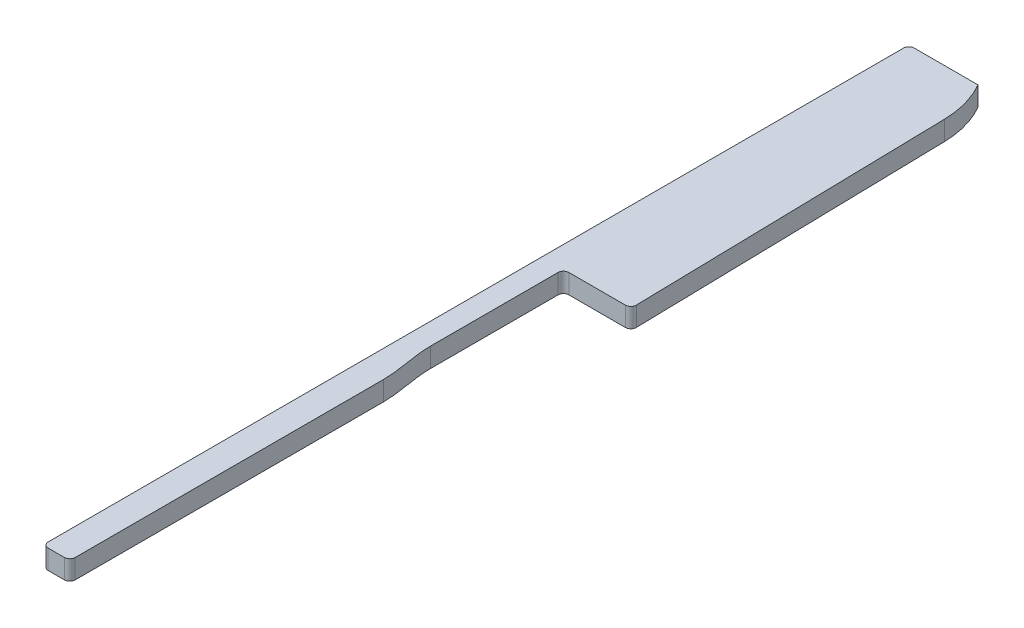
ISO-10303-21;
HEADER;
FILE_DESCRIPTION(('STEP AP214'),'2;1');
FILE_NAME('part.step','',(''),(''),'','','');
FILE_SCHEMA(('AUTOMOTIVE_DESIGN { 1 0 10303 214 1 1 1 1 }'));
ENDSEC;
DATA;
#1=APPLICATION_CONTEXT('core data for automotive mechanical design processes');
#2=APPLICATION_PROTOCOL_DEFINITION('international standard','automotive_design',2000,#1);
#3=PRODUCT_CONTEXT('',#1,'mechanical');
#4=PRODUCT('Part','Part','',(#3));
#5=PRODUCT_RELATED_PRODUCT_CATEGORY('part','',(#4));
#6=PRODUCT_DEFINITION_FORMATION('','',#4);
#7=PRODUCT_DEFINITION_CONTEXT('part definition',#1,'design');
#8=PRODUCT_DEFINITION('design','',#6,#7);
#9=PRODUCT_DEFINITION_SHAPE('','',#8);
#10=(LENGTH_UNIT() NAMED_UNIT(*) SI_UNIT(.MILLI.,.METRE.));
#11=(NAMED_UNIT(*) PLANE_ANGLE_UNIT() SI_UNIT($,.RADIAN.));
#12=(NAMED_UNIT(*) SI_UNIT($,.STERADIAN.) SOLID_ANGLE_UNIT());
#13=UNCERTAINTY_MEASURE_WITH_UNIT(LENGTH_MEASURE(1.E-05),#10,'distance_accuracy_value','');
#14=(GEOMETRIC_REPRESENTATION_CONTEXT(3) GLOBAL_UNCERTAINTY_ASSIGNED_CONTEXT((#13)) GLOBAL_UNIT_ASSIGNED_CONTEXT((#10,
#11,#12)) REPRESENTATION_CONTEXT('',''));
#15=CARTESIAN_POINT('',(0.,0.,0.));
#16=DIRECTION('',(0.,0.,1.));
#17=DIRECTION('',(1.,0.,0.));
#18=AXIS2_PLACEMENT_3D('',#15,#16,#17);
#19=CARTESIAN_POINT('',(12.5,1.8,-32.33));
#20=DIRECTION('',(-1.,0.,0.));
#21=DIRECTION('',(0.,0.,1.));
#22=AXIS2_PLACEMENT_3D('',#19,#20,#21);
#23=PLANE('',#22);
#24=DIRECTION('',(0.,0.,-1.));
#25=VECTOR('',#24,1.);
#26=CARTESIAN_POINT('',(12.5,1.8,-32.33));
#27=LINE('',#26,#25);
#28=CARTESIAN_POINT('',(12.5,1.8,-3.77));
#29=VERTEX_POINT('',#28);
#30=CARTESIAN_POINT('',(12.5,1.8,-32.33));
#31=VERTEX_POINT('',#30);
#32=EDGE_CURVE('E137',#29,#31,#27,.T.);
#33=ORIENTED_EDGE('',*,*,#32,.F.);
#34=DIRECTION('',(0.,-1.,0.));
#35=VECTOR('',#34,1.);
#36=CARTESIAN_POINT('',(12.5,1.8,-3.77));
#37=LINE('',#36,#35);
#38=CARTESIAN_POINT('',(12.5,0.,-3.77));
#39=VERTEX_POINT('',#38);
#40=EDGE_CURVE('E11',#29,#39,#37,.T.);
#41=ORIENTED_EDGE('',*,*,#40,.T.);
#42=DIRECTION('',(0.,0.,-1.));
#43=VECTOR('',#42,1.);
#44=CARTESIAN_POINT('',(12.5,0.,-32.33));
#45=LINE('',#44,#43);
#46=CARTESIAN_POINT('',(12.5,0.,-32.33));
#47=VERTEX_POINT('',#46);
#48=EDGE_CURVE('E154',#39,#47,#45,.T.);
#49=ORIENTED_EDGE('',*,*,#48,.T.);
#50=DIRECTION('',(0.,-1.,0.));
#51=VECTOR('',#50,1.);
#52=CARTESIAN_POINT('',(12.5,1.8,-32.33));
#53=LINE('',#52,#51);
#54=EDGE_CURVE('E152',#31,#47,#53,.T.);
#55=ORIENTED_EDGE('',*,*,#54,.F.);
#56=EDGE_LOOP('',(#33,#41,#49,#55));
#57=FACE_BOUND('',#56,.T.);
#58=ADVANCED_FACE('F35',(#57),#23,.F.);
#59=CARTESIAN_POINT('',(12.5,1.8,-32.33));
#60=CARTESIAN_POINT('',(12.5,1.8,-33.9722823380889));
#61=CARTESIAN_POINT('',(12.,1.8,-35.554764974261));
#62=CARTESIAN_POINT('',(12.,1.8,-37.18));
#63=B_SPLINE_CURVE_WITH_KNOTS('',3,(#59,#60,#61,#62),.UNSPECIFIED.,.F.,.F.,(4,4),(0.,1.),.UNSPECIFIED.);
#64=DIRECTION('',(0.,-1.,0.));
#65=VECTOR('',#64,1.);
#66=SURFACE_OF_LINEAR_EXTRUSION('',#63,#65);
#67=CARTESIAN_POINT('',(12.5,0.,-32.33));
#68=CARTESIAN_POINT('',(12.5,0.,-33.9722823380889));
#69=CARTESIAN_POINT('',(12.,0.,-35.554764974261));
#70=CARTESIAN_POINT('',(12.,0.,-37.18));
#71=B_SPLINE_CURVE_WITH_KNOTS('',3,(#67,#68,#69,#70),.UNSPECIFIED.,.F.,.F.,(4,4),(0.,1.),.UNSPECIFIED.);
#72=CARTESIAN_POINT('',(12.,0.,-37.18));
#73=VERTEX_POINT('',#72);
#74=EDGE_CURVE('E268',#47,#73,#71,.T.);
#75=ORIENTED_EDGE('',*,*,#74,.T.);
#76=DIRECTION('',(0.,-1.,0.));
#77=VECTOR('',#76,1.);
#78=CARTESIAN_POINT('',(12.,1.8,-37.18));
#79=LINE('',#78,#77);
#80=CARTESIAN_POINT('',(12.,1.8,-37.18));
#81=VERTEX_POINT('',#80);
#82=EDGE_CURVE('E158',#81,#73,#79,.T.);
#83=ORIENTED_EDGE('',*,*,#82,.F.);
#84=EDGE_CURVE('E143',#31,#81,#63,.T.);
#85=ORIENTED_EDGE('',*,*,#84,.F.);
#86=ORIENTED_EDGE('',*,*,#54,.T.);
#87=EDGE_LOOP('',(#75,#83,#85,#86));
#88=FACE_BOUND('',#87,.T.);
#89=ADVANCED_FACE('F160',(#88),#66,.F.);
#90=CARTESIAN_POINT('',(12.,1.8,-37.18));
#91=DIRECTION('',(-1.,0.,0.));
#92=DIRECTION('',(0.,0.,1.));
#93=AXIS2_PLACEMENT_3D('',#90,#91,#92);
#94=PLANE('',#93);
#95=DIRECTION('',(0.,0.,-1.));
#96=VECTOR('',#95,1.);
#97=CARTESIAN_POINT('',(12.,0.,-37.18));
#98=LINE('',#97,#96);
#99=CARTESIAN_POINT('',(12.,0.,-49.));
#100=VERTEX_POINT('',#99);
#101=EDGE_CURVE('E265',#73,#100,#98,.T.);
#102=ORIENTED_EDGE('',*,*,#101,.T.);
#103=DIRECTION('',(0.,-1.,0.));
#104=VECTOR('',#103,1.);
#105=CARTESIAN_POINT('',(12.,1.8,-49.));
#106=LINE('',#105,#104);
#107=CARTESIAN_POINT('',(12.,1.8,-49.));
#108=VERTEX_POINT('',#107);
#109=EDGE_CURVE('E240',#100,#108,#106,.F.);
#110=ORIENTED_EDGE('',*,*,#109,.T.);
#111=DIRECTION('',(0.,0.,-1.));
#112=VECTOR('',#111,1.);
#113=CARTESIAN_POINT('',(12.,1.8,-37.18));
#114=LINE('',#113,#112);
#115=EDGE_CURVE('E163',#81,#108,#114,.T.);
#116=ORIENTED_EDGE('',*,*,#115,.F.);
#117=ORIENTED_EDGE('',*,*,#82,.T.);
#118=EDGE_LOOP('',(#102,#110,#116,#117));
#119=FACE_BOUND('',#118,.T.);
#120=ADVANCED_FACE('F179',(#119),#94,.F.);
#121=CARTESIAN_POINT('',(18.25,1.8,-49.5));
#122=DIRECTION('',(0.,0.,-1.));
#123=DIRECTION('',(-1.,0.,0.));
#124=AXIS2_PLACEMENT_3D('',#121,#122,#123);
#125=PLANE('',#124);
#126=DIRECTION('',(1.,0.,0.));
#127=VECTOR('',#126,1.);
#128=CARTESIAN_POINT('',(18.25,1.8,-49.5));
#129=LINE('',#128,#127);
#130=CARTESIAN_POINT('',(12.5,1.8,-49.5));
#131=VERTEX_POINT('',#130);
#132=CARTESIAN_POINT('',(17.7389709464066,1.8,-49.5));
#133=VERTEX_POINT('',#132);
#134=EDGE_CURVE('E165',#131,#133,#129,.T.);
#135=ORIENTED_EDGE('',*,*,#134,.F.);
#136=DIRECTION('',(0.,-1.,0.));
#137=VECTOR('',#136,1.);
#138=CARTESIAN_POINT('',(12.5,0.,-49.5));
#139=LINE('',#138,#137);
#140=CARTESIAN_POINT('',(12.5,0.,-49.5));
#141=VERTEX_POINT('',#140);
#142=EDGE_CURVE('E242',#131,#141,#139,.T.);
#143=ORIENTED_EDGE('',*,*,#142,.T.);
#144=DIRECTION('',(1.,0.,0.));
#145=VECTOR('',#144,1.);
#146=CARTESIAN_POINT('',(18.25,0.,-49.5));
#147=LINE('',#146,#145);
#148=CARTESIAN_POINT('',(17.7389709464066,0.,-49.5));
#149=VERTEX_POINT('',#148);
#150=EDGE_CURVE('E262',#141,#149,#147,.T.);
#151=ORIENTED_EDGE('',*,*,#150,.T.);
#152=DIRECTION('',(0.,-1.,0.));
#153=VECTOR('',#152,1.);
#154=CARTESIAN_POINT('',(17.7389709464066,1.8,-49.5));
#155=LINE('',#154,#153);
#156=EDGE_CURVE('E157',#149,#133,#155,.F.);
#157=ORIENTED_EDGE('',*,*,#156,.T.);
#158=EDGE_LOOP('',(#135,#143,#151,#157));
#159=FACE_BOUND('',#158,.T.);
#160=ADVANCED_FACE('F318',(#159),#125,.F.);
#161=CARTESIAN_POINT('',(17.6019605823982,1.8,-79.1992260441899));
#162=DIRECTION('',(-0.999762027079909,0.,0.0218148850345542));
#163=DIRECTION('',(0.0218148850345542,0.,0.999762027079909));
#164=AXIS2_PLACEMENT_3D('',#161,#162,#163);
#165=PLANE('',#164);
#166=DIRECTION('',(-0.0218148850345542,0.,-0.999762027079909));
#167=VECTOR('',#166,1.);
#168=CARTESIAN_POINT('',(17.6019605823982,1.8,-79.1992260441899));
#169=LINE('',#168,#167);
#170=CARTESIAN_POINT('',(18.2388519599465,1.8,-50.0109074425173));
#171=VERTEX_POINT('',#170);
#172=CARTESIAN_POINT('',(17.6019605823982,1.8,-79.1992260441899));
#173=VERTEX_POINT('',#172);
#174=EDGE_CURVE('E283',#171,#173,#169,.T.);
#175=ORIENTED_EDGE('',*,*,#174,.F.);
#176=DIRECTION('',(0.,-1.,0.));
#177=VECTOR('',#176,1.);
#178=CARTESIAN_POINT('',(18.2388519599465,1.8,-50.0109074425173));
#179=LINE('',#178,#177);
#180=CARTESIAN_POINT('',(18.2388519599465,0.,-50.0109074425173));
#181=VERTEX_POINT('',#180);
#182=EDGE_CURVE('E237',#171,#181,#179,.T.);
#183=ORIENTED_EDGE('',*,*,#182,.T.);
#184=DIRECTION('',(-0.0218148850345542,0.,-0.999762027079909));
#185=VECTOR('',#184,1.);
#186=CARTESIAN_POINT('',(17.6019605823982,0.,-79.1992260441899));
#187=LINE('',#186,#185);
#188=CARTESIAN_POINT('',(17.6019605823982,0.,-79.1992260441899));
#189=VERTEX_POINT('',#188);
#190=EDGE_CURVE('E260',#181,#189,#187,.T.);
#191=ORIENTED_EDGE('',*,*,#190,.T.);
#192=DIRECTION('',(0.,-1.,0.));
#193=VECTOR('',#192,1.);
#194=CARTESIAN_POINT('',(17.6019605823982,1.8,-79.1992260441899));
#195=LINE('',#194,#193);
#196=EDGE_CURVE('E247',#173,#189,#195,.T.);
#197=ORIENTED_EDGE('',*,*,#196,.F.);
#198=EDGE_LOOP('',(#175,#183,#191,#197));
#199=FACE_BOUND('',#198,.T.);
#200=ADVANCED_FACE('F295',(#199),#165,.F.);
#201=CARTESIAN_POINT('',(8.60410233867904,1.8,-79.0028920788789));
#202=DIRECTION('',(0.,-1.,0.));
#203=DIRECTION('',(0.,0.,-1.));
#204=AXIS2_PLACEMENT_3D('',#201,#202,#203);
#205=CYLINDRICAL_SURFACE('',#204,9.);
#206=CARTESIAN_POINT('',(8.60410233867904,0.,-79.0028920788789));
#207=DIRECTION('',(0.,1.,0.));
#208=DIRECTION('',(0.,0.,1.));
#209=AXIS2_PLACEMENT_3D('',#206,#207,#208);
#210=CIRCLE('',#209,9.);
#211=CARTESIAN_POINT('',(16.4,0.,-83.5));
#212=VERTEX_POINT('',#211);
#213=EDGE_CURVE('E258',#189,#212,#210,.T.);
#214=ORIENTED_EDGE('',*,*,#213,.T.);
#215=DIRECTION('',(0.,-1.,0.));
#216=VECTOR('',#215,1.);
#217=CARTESIAN_POINT('',(16.4,1.8,-83.5));
#218=LINE('',#217,#216);
#219=CARTESIAN_POINT('',(16.4,1.8,-83.5));
#220=VERTEX_POINT('',#219);
#221=EDGE_CURVE('E250',#220,#212,#218,.T.);
#222=ORIENTED_EDGE('',*,*,#221,.F.);
#223=CARTESIAN_POINT('',(8.60410233867904,1.8,-79.0028920788789));
#224=DIRECTION('',(0.,1.,0.));
#225=DIRECTION('',(0.,0.,1.));
#226=AXIS2_PLACEMENT_3D('',#223,#224,#225);
#227=CIRCLE('',#226,9.);
#228=EDGE_CURVE('E281',#173,#220,#227,.T.);
#229=ORIENTED_EDGE('',*,*,#228,.F.);
#230=ORIENTED_EDGE('',*,*,#196,.T.);
#231=EDGE_LOOP('',(#214,#222,#229,#230));
#232=FACE_BOUND('',#231,.T.);
#233=ADVANCED_FACE('F302',(#232),#205,.T.);
#234=CARTESIAN_POINT('',(10.,1.8,-83.5));
#235=DIRECTION('',(0.,0.,1.));
#236=DIRECTION('',(1.,0.,0.));
#237=AXIS2_PLACEMENT_3D('',#234,#235,#236);
#238=PLANE('',#237);
#239=DIRECTION('',(-1.,0.,0.));
#240=VECTOR('',#239,1.);
#241=CARTESIAN_POINT('',(10.,0.,-83.5));
#242=LINE('',#241,#240);
#243=CARTESIAN_POINT('',(10.5,0.,-83.5));
#244=VERTEX_POINT('',#243);
#245=EDGE_CURVE('E255',#212,#244,#242,.T.);
#246=ORIENTED_EDGE('',*,*,#245,.T.);
#247=DIRECTION('',(0.,-1.,0.));
#248=VECTOR('',#247,1.);
#249=CARTESIAN_POINT('',(10.5,1.8,-83.5));
#250=LINE('',#249,#248);
#251=CARTESIAN_POINT('',(10.5,1.8,-83.5));
#252=VERTEX_POINT('',#251);
#253=EDGE_CURVE('E224',#244,#252,#250,.F.);
#254=ORIENTED_EDGE('',*,*,#253,.T.);
#255=DIRECTION('',(-1.,0.,0.));
#256=VECTOR('',#255,1.);
#257=CARTESIAN_POINT('',(10.,1.8,-83.5));
#258=LINE('',#257,#256);
#259=EDGE_CURVE('E278',#220,#252,#258,.T.);
#260=ORIENTED_EDGE('',*,*,#259,.F.);
#261=ORIENTED_EDGE('',*,*,#221,.T.);
#262=EDGE_LOOP('',(#246,#254,#260,#261));
#263=FACE_BOUND('',#262,.T.);
#264=ADVANCED_FACE('F306',(#263),#238,.F.);
#265=CARTESIAN_POINT('',(10.,1.8,-14.4));
#266=DIRECTION('',(1.,0.,0.));
#267=DIRECTION('',(0.,0.,-1.));
#268=AXIS2_PLACEMENT_3D('',#265,#266,#267);
#269=PLANE('',#268);
#270=DIRECTION('',(0.,0.,1.));
#271=VECTOR('',#270,1.);
#272=CARTESIAN_POINT('',(10.,0.,-14.4));
#273=LINE('',#272,#271);
#274=CARTESIAN_POINT('',(10.,0.,-83.));
#275=VERTEX_POINT('',#274);
#276=CARTESIAN_POINT('',(10.,0.,-3.77));
#277=VERTEX_POINT('',#276);
#278=EDGE_CURVE('E149',#275,#277,#273,.T.);
#279=ORIENTED_EDGE('',*,*,#278,.T.);
#280=DIRECTION('',(0.,1.,0.));
#281=VECTOR('',#280,1.);
#282=CARTESIAN_POINT('',(10.,1.8,-3.77));
#283=LINE('',#282,#281);
#284=CARTESIAN_POINT('',(10.,1.8,-3.77));
#285=VERTEX_POINT('',#284);
#286=EDGE_CURVE('E207',#277,#285,#283,.T.);
#287=ORIENTED_EDGE('',*,*,#286,.T.);
#288=DIRECTION('',(0.,0.,1.));
#289=VECTOR('',#288,1.);
#290=CARTESIAN_POINT('',(10.,1.8,-14.4));
#291=LINE('',#290,#289);
#292=CARTESIAN_POINT('',(10.,1.8,-83.));
#293=VERTEX_POINT('',#292);
#294=EDGE_CURVE('E253',#293,#285,#291,.T.);
#295=ORIENTED_EDGE('',*,*,#294,.F.);
#296=DIRECTION('',(0.,-1.,0.));
#297=VECTOR('',#296,1.);
#298=CARTESIAN_POINT('',(10.,1.8,-83.));
#299=LINE('',#298,#297);
#300=EDGE_CURVE('E226',#293,#275,#299,.T.);
#301=ORIENTED_EDGE('',*,*,#300,.T.);
#302=EDGE_LOOP('',(#279,#287,#295,#301));
#303=FACE_BOUND('',#302,.T.);
#304=ADVANCED_FACE('F312',(#303),#269,.F.);
#305=CARTESIAN_POINT('',(9.43,1.8,-12.1305444444443));
#306=DIRECTION('',(0.,-1.,0.));
#307=DIRECTION('',(0.,0.,-1.));
#308=AXIS2_PLACEMENT_3D('',#305,#306,#307);
#309=PLANE('',#308);
#310=ORIENTED_EDGE('',*,*,#294,.T.);
#311=CARTESIAN_POINT('',(10.5,1.8,-3.77));
#312=DIRECTION('',(0.,-1.,0.));
#313=DIRECTION('',(0.,0.,-1.));
#314=AXIS2_PLACEMENT_3D('',#311,#312,#313);
#315=CIRCLE('',#314,0.5);
#316=CARTESIAN_POINT('',(10.5,1.8,-3.27));
#317=VERTEX_POINT('',#316);
#318=EDGE_CURVE('E216',#285,#317,#315,.F.);
#319=ORIENTED_EDGE('',*,*,#318,.T.);
#320=DIRECTION('',(-1.,0.,0.));
#321=VECTOR('',#320,1.);
#322=CARTESIAN_POINT('',(10.,1.8,-3.27));
#323=LINE('',#322,#321);
#324=CARTESIAN_POINT('',(12.,1.8,-3.27));
#325=VERTEX_POINT('',#324);
#326=EDGE_CURVE('E313',#325,#317,#323,.T.);
#327=ORIENTED_EDGE('',*,*,#326,.F.);
#328=CARTESIAN_POINT('',(12.,1.8,-3.77));
#329=DIRECTION('',(0.,-1.,0.));
#330=DIRECTION('',(0.,0.,-1.));
#331=AXIS2_PLACEMENT_3D('',#328,#329,#330);
#332=CIRCLE('',#331,0.5);
#333=EDGE_CURVE('E147',#325,#29,#332,.F.);
#334=ORIENTED_EDGE('',*,*,#333,.T.);
#335=ORIENTED_EDGE('',*,*,#32,.T.);
#336=ORIENTED_EDGE('',*,*,#84,.T.);
#337=ORIENTED_EDGE('',*,*,#115,.T.);
#338=CARTESIAN_POINT('',(12.5,1.8,-49.));
#339=DIRECTION('',(0.,-1.,0.));
#340=DIRECTION('',(0.,0.,-1.));
#341=AXIS2_PLACEMENT_3D('',#338,#339,#340);
#342=CIRCLE('',#341,0.5);
#343=EDGE_CURVE('E220',#108,#131,#342,.T.);
#344=ORIENTED_EDGE('',*,*,#343,.T.);
#345=ORIENTED_EDGE('',*,*,#134,.T.);
#346=CARTESIAN_POINT('',(17.7389709464066,1.8,-50.));
#347=DIRECTION('',(0.,-1.,0.));
#348=DIRECTION('',(0.,0.,-1.));
#349=AXIS2_PLACEMENT_3D('',#346,#347,#348);
#350=CIRCLE('',#349,0.5);
#351=EDGE_CURVE('E229',#133,#171,#350,.F.);
#352=ORIENTED_EDGE('',*,*,#351,.T.);
#353=ORIENTED_EDGE('',*,*,#174,.T.);
#354=ORIENTED_EDGE('',*,*,#228,.T.);
#355=ORIENTED_EDGE('',*,*,#259,.T.);
#356=CARTESIAN_POINT('',(10.5,1.8,-83.));
#357=DIRECTION('',(0.,-1.,0.));
#358=DIRECTION('',(0.,0.,-1.));
#359=AXIS2_PLACEMENT_3D('',#356,#357,#358);
#360=CIRCLE('',#359,0.5);
#361=EDGE_CURVE('E231',#252,#293,#360,.F.);
#362=ORIENTED_EDGE('',*,*,#361,.T.);
#363=EDGE_LOOP('',(#310,#319,#327,#334,#335,#336,#337,#344,#345,#352,#353,#354,#355,#362));
#364=FACE_BOUND('',#363,.T.);
#365=ADVANCED_FACE('F140',(#364),#309,.F.);
#366=CARTESIAN_POINT('',(9.43,0.,-12.1305444444443));
#367=DIRECTION('',(0.,-1.,0.));
#368=DIRECTION('',(0.,0.,-1.));
#369=AXIS2_PLACEMENT_3D('',#366,#367,#368);
#370=PLANE('',#369);
#371=DIRECTION('',(-1.,0.,0.));
#372=VECTOR('',#371,1.);
#373=CARTESIAN_POINT('',(10.,0.,-3.27));
#374=LINE('',#373,#372);
#375=CARTESIAN_POINT('',(12.,0.,-3.27));
#376=VERTEX_POINT('',#375);
#377=CARTESIAN_POINT('',(10.5,0.,-3.27));
#378=VERTEX_POINT('',#377);
#379=EDGE_CURVE('E276',#376,#378,#374,.T.);
#380=ORIENTED_EDGE('',*,*,#379,.T.);
#381=CARTESIAN_POINT('',(10.5,0.,-3.77));
#382=DIRECTION('',(0.,-1.,0.));
#383=DIRECTION('',(0.,0.,-1.));
#384=AXIS2_PLACEMENT_3D('',#381,#382,#383);
#385=CIRCLE('',#384,0.5);
#386=EDGE_CURVE('E43',#378,#277,#385,.T.);
#387=ORIENTED_EDGE('',*,*,#386,.T.);
#388=ORIENTED_EDGE('',*,*,#278,.F.);
#389=CARTESIAN_POINT('',(10.5,0.,-83.));
#390=DIRECTION('',(0.,-1.,0.));
#391=DIRECTION('',(0.,0.,-1.));
#392=AXIS2_PLACEMENT_3D('',#389,#390,#391);
#393=CIRCLE('',#392,0.5);
#394=EDGE_CURVE('E235',#275,#244,#393,.T.);
#395=ORIENTED_EDGE('',*,*,#394,.T.);
#396=ORIENTED_EDGE('',*,*,#245,.F.);
#397=ORIENTED_EDGE('',*,*,#213,.F.);
#398=ORIENTED_EDGE('',*,*,#190,.F.);
#399=CARTESIAN_POINT('',(17.7389709464066,0.,-50.));
#400=DIRECTION('',(0.,-1.,0.));
#401=DIRECTION('',(0.,0.,-1.));
#402=AXIS2_PLACEMENT_3D('',#399,#400,#401);
#403=CIRCLE('',#402,0.5);
#404=EDGE_CURVE('E233',#181,#149,#403,.T.);
#405=ORIENTED_EDGE('',*,*,#404,.T.);
#406=ORIENTED_EDGE('',*,*,#150,.F.);
#407=CARTESIAN_POINT('',(12.5,0.,-49.));
#408=DIRECTION('',(0.,-1.,0.));
#409=DIRECTION('',(0.,0.,-1.));
#410=AXIS2_PLACEMENT_3D('',#407,#408,#409);
#411=CIRCLE('',#410,0.5);
#412=EDGE_CURVE('E222',#141,#100,#411,.F.);
#413=ORIENTED_EDGE('',*,*,#412,.T.);
#414=ORIENTED_EDGE('',*,*,#101,.F.);
#415=ORIENTED_EDGE('',*,*,#74,.F.);
#416=ORIENTED_EDGE('',*,*,#48,.F.);
#417=CARTESIAN_POINT('',(12.,0.,-3.77));
#418=DIRECTION('',(0.,-1.,0.));
#419=DIRECTION('',(0.,0.,-1.));
#420=AXIS2_PLACEMENT_3D('',#417,#418,#419);
#421=CIRCLE('',#420,0.5);
#422=EDGE_CURVE('E50',#39,#376,#421,.T.);
#423=ORIENTED_EDGE('',*,*,#422,.T.);
#424=EDGE_LOOP('',(#380,#387,#388,#395,#396,#397,#398,#405,#406,#413,#414,#415,#416,#423));
#425=FACE_BOUND('',#424,.T.);
#426=ADVANCED_FACE('F187',(#425),#370,.T.);
#427=CARTESIAN_POINT('',(12.5,1.8,-49.));
#428=DIRECTION('',(0.,1.,0.));
#429=DIRECTION('',(0.,0.,1.));
#430=AXIS2_PLACEMENT_3D('',#427,#428,#429);
#431=CYLINDRICAL_SURFACE('',#430,0.5);
#432=ORIENTED_EDGE('',*,*,#343,.F.);
#433=ORIENTED_EDGE('',*,*,#109,.F.);
#434=ORIENTED_EDGE('',*,*,#412,.F.);
#435=ORIENTED_EDGE('',*,*,#142,.F.);
#436=EDGE_LOOP('',(#432,#433,#434,#435));
#437=FACE_BOUND('',#436,.T.);
#438=ADVANCED_FACE('F183',(#437),#431,.F.);
#439=CARTESIAN_POINT('',(17.7389709464066,1.8,-50.));
#440=DIRECTION('',(0.,-1.,0.));
#441=DIRECTION('',(0.,0.,-1.));
#442=AXIS2_PLACEMENT_3D('',#439,#440,#441);
#443=CYLINDRICAL_SURFACE('',#442,0.5);
#444=ORIENTED_EDGE('',*,*,#351,.F.);
#445=ORIENTED_EDGE('',*,*,#156,.F.);
#446=ORIENTED_EDGE('',*,*,#404,.F.);
#447=ORIENTED_EDGE('',*,*,#182,.F.);
#448=EDGE_LOOP('',(#444,#445,#446,#447));
#449=FACE_BOUND('',#448,.T.);
#450=ADVANCED_FACE('F186',(#449),#443,.T.);
#451=CARTESIAN_POINT('',(10.5,1.8,-83.));
#452=DIRECTION('',(0.,-1.,0.));
#453=DIRECTION('',(0.,0.,-1.));
#454=AXIS2_PLACEMENT_3D('',#451,#452,#453);
#455=CYLINDRICAL_SURFACE('',#454,0.5);
#456=ORIENTED_EDGE('',*,*,#361,.F.);
#457=ORIENTED_EDGE('',*,*,#253,.F.);
#458=ORIENTED_EDGE('',*,*,#394,.F.);
#459=ORIENTED_EDGE('',*,*,#300,.F.);
#460=EDGE_LOOP('',(#456,#457,#458,#459));
#461=FACE_BOUND('',#460,.T.);
#462=ADVANCED_FACE('F191',(#461),#455,.T.);
#463=CARTESIAN_POINT('',(10.,0.,-3.27));
#464=DIRECTION('',(0.,0.,-1.));
#465=DIRECTION('',(-1.,0.,0.));
#466=AXIS2_PLACEMENT_3D('',#463,#464,#465);
#467=PLANE('',#466);
#468=ORIENTED_EDGE('',*,*,#326,.T.);
#469=DIRECTION('',(0.,1.,0.));
#470=VECTOR('',#469,1.);
#471=CARTESIAN_POINT('',(10.5,0.,-3.27));
#472=LINE('',#471,#470);
#473=EDGE_CURVE('E57',#317,#378,#472,.F.);
#474=ORIENTED_EDGE('',*,*,#473,.T.);
#475=ORIENTED_EDGE('',*,*,#379,.F.);
#476=DIRECTION('',(0.,-1.,0.));
#477=VECTOR('',#476,1.);
#478=CARTESIAN_POINT('',(12.,0.,-3.27));
#479=LINE('',#478,#477);
#480=EDGE_CURVE('E214',#376,#325,#479,.F.);
#481=ORIENTED_EDGE('',*,*,#480,.T.);
#482=EDGE_LOOP('',(#468,#474,#475,#481));
#483=FACE_BOUND('',#482,.T.);
#484=ADVANCED_FACE('F194',(#483),#467,.F.);
#485=CARTESIAN_POINT('',(10.5,1.8,-3.77));
#486=DIRECTION('',(0.,1.,0.));
#487=DIRECTION('',(0.,0.,1.));
#488=AXIS2_PLACEMENT_3D('',#485,#486,#487);
#489=CYLINDRICAL_SURFACE('',#488,0.5);
#490=ORIENTED_EDGE('',*,*,#386,.F.);
#491=ORIENTED_EDGE('',*,*,#473,.F.);
#492=ORIENTED_EDGE('',*,*,#318,.F.);
#493=ORIENTED_EDGE('',*,*,#286,.F.);
#494=EDGE_LOOP('',(#490,#491,#492,#493));
#495=FACE_BOUND('',#494,.T.);
#496=ADVANCED_FACE('F196',(#495),#489,.T.);
#497=CARTESIAN_POINT('',(12.,1.8,-3.77));
#498=DIRECTION('',(0.,-1.,0.));
#499=DIRECTION('',(0.,0.,-1.));
#500=AXIS2_PLACEMENT_3D('',#497,#498,#499);
#501=CYLINDRICAL_SURFACE('',#500,0.5);
#502=ORIENTED_EDGE('',*,*,#333,.F.);
#503=ORIENTED_EDGE('',*,*,#480,.F.);
#504=ORIENTED_EDGE('',*,*,#422,.F.);
#505=ORIENTED_EDGE('',*,*,#40,.F.);
#506=EDGE_LOOP('',(#502,#503,#504,#505));
#507=FACE_BOUND('',#506,.T.);
#508=ADVANCED_FACE('F37',(#507),#501,.T.);
#509=CLOSED_SHELL('',(#58,#89,#120,#160,#200,#233,#264,#304,#365,#426,#438,#450,#462,#484,#496,#508));
#510=MANIFOLD_SOLID_BREP('B2',#509);
#511=ADVANCED_BREP_SHAPE_REPRESENTATION('',(#18,#510),#14);
#512=SHAPE_DEFINITION_REPRESENTATION(#9,#511);
ENDSEC;
END-ISO-10303-21;
